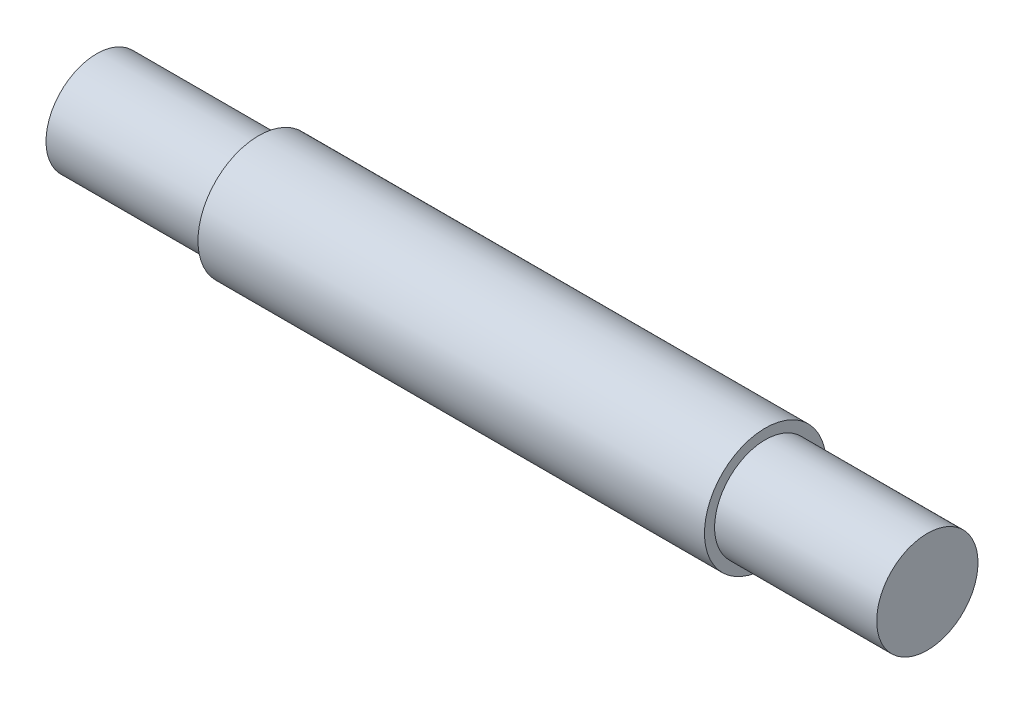
ISO-10303-21;
HEADER;
FILE_DESCRIPTION(('STEP AP214'),'2;1');
FILE_NAME('part.step','',(''),(''),'','','');
FILE_SCHEMA(('AUTOMOTIVE_DESIGN { 1 0 10303 214 1 1 1 1 }'));
ENDSEC;
DATA;
#1=APPLICATION_CONTEXT('core data for automotive mechanical design processes');
#2=APPLICATION_PROTOCOL_DEFINITION('international standard','automotive_design',2000,#1);
#3=PRODUCT_CONTEXT('',#1,'mechanical');
#4=PRODUCT('Part','Part','',(#3));
#5=PRODUCT_RELATED_PRODUCT_CATEGORY('part','',(#4));
#6=PRODUCT_DEFINITION_FORMATION('','',#4);
#7=PRODUCT_DEFINITION_CONTEXT('part definition',#1,'design');
#8=PRODUCT_DEFINITION('design','',#6,#7);
#9=PRODUCT_DEFINITION_SHAPE('','',#8);
#10=(LENGTH_UNIT() NAMED_UNIT(*) SI_UNIT(.MILLI.,.METRE.));
#11=(NAMED_UNIT(*) PLANE_ANGLE_UNIT() SI_UNIT($,.RADIAN.));
#12=(NAMED_UNIT(*) SI_UNIT($,.STERADIAN.) SOLID_ANGLE_UNIT());
#13=UNCERTAINTY_MEASURE_WITH_UNIT(LENGTH_MEASURE(1.E-05),#10,'distance_accuracy_value','');
#14=(GEOMETRIC_REPRESENTATION_CONTEXT(3) GLOBAL_UNCERTAINTY_ASSIGNED_CONTEXT((#13)) GLOBAL_UNIT_ASSIGNED_CONTEXT((#10,
#11,#12)) REPRESENTATION_CONTEXT('',''));
#15=CARTESIAN_POINT('',(0.,0.,0.));
#16=DIRECTION('',(0.,0.,1.));
#17=DIRECTION('',(1.,0.,0.));
#18=AXIS2_PLACEMENT_3D('',#15,#16,#17);
#19=CARTESIAN_POINT('',(50.,0.,0.));
#20=DIRECTION('',(-1.,0.,0.));
#21=DIRECTION('',(0.,0.,1.));
#22=AXIS2_PLACEMENT_3D('',#19,#20,#21);
#23=CYLINDRICAL_SURFACE('',#22,6.);
#24=CARTESIAN_POINT('',(50.,0.,0.));
#25=DIRECTION('',(1.,0.,0.));
#26=DIRECTION('',(0.,0.,-1.));
#27=AXIS2_PLACEMENT_3D('',#24,#25,#26);
#28=CIRCLE('',#27,6.);
#29=CARTESIAN_POINT('',(50.,0.,-6.));
#30=VERTEX_POINT('',#29);
#31=EDGE_CURVE('E51',#30,#30,#28,.T.);
#32=ORIENTED_EDGE('',*,*,#31,.F.);
#33=EDGE_LOOP('',(#32));
#34=FACE_BOUND('',#33,.T.);
#35=CARTESIAN_POINT('',(0.,0.,0.));
#36=DIRECTION('',(1.,0.,0.));
#37=DIRECTION('',(0.,0.,-1.));
#38=AXIS2_PLACEMENT_3D('',#35,#36,#37);
#39=CIRCLE('',#38,6.);
#40=CARTESIAN_POINT('',(0.,0.,-6.));
#41=VERTEX_POINT('',#40);
#42=EDGE_CURVE('E40',#41,#41,#39,.T.);
#43=ORIENTED_EDGE('',*,*,#42,.T.);
#44=EDGE_LOOP('',(#43));
#45=FACE_BOUND('',#44,.T.);
#46=ADVANCED_FACE('F37',(#34,#45),#23,.T.);
#47=CARTESIAN_POINT('',(50.,0.,0.));
#48=DIRECTION('',(1.,0.,0.));
#49=DIRECTION('',(0.,0.,-1.));
#50=AXIS2_PLACEMENT_3D('',#47,#48,#49);
#51=PLANE('',#50);
#52=CARTESIAN_POINT('',(50.,0.,0.));
#53=DIRECTION('',(1.,0.,0.));
#54=DIRECTION('',(0.,0.,-1.));
#55=AXIS2_PLACEMENT_3D('',#52,#53,#54);
#56=CIRCLE('',#55,5.);
#57=CARTESIAN_POINT('',(50.,0.,-5.));
#58=VERTEX_POINT('',#57);
#59=EDGE_CURVE('E10',#58,#58,#56,.T.);
#60=ORIENTED_EDGE('',*,*,#59,.F.);
#61=EDGE_LOOP('',(#60));
#62=FACE_BOUND('',#61,.T.);
#63=ORIENTED_EDGE('',*,*,#31,.T.);
#64=EDGE_LOOP('',(#63));
#65=FACE_BOUND('',#64,.T.);
#66=ADVANCED_FACE('F71',(#62,#65),#51,.T.);
#67=CARTESIAN_POINT('',(0.,0.,0.));
#68=DIRECTION('',(1.,0.,0.));
#69=DIRECTION('',(0.,0.,-1.));
#70=AXIS2_PLACEMENT_3D('',#67,#68,#69);
#71=PLANE('',#70);
#72=CARTESIAN_POINT('',(0.,0.,0.));
#73=DIRECTION('',(-1.,0.,0.));
#74=DIRECTION('',(0.,0.,1.));
#75=AXIS2_PLACEMENT_3D('',#72,#73,#74);
#76=CIRCLE('',#75,5.);
#77=CARTESIAN_POINT('',(0.,0.,5.));
#78=VERTEX_POINT('',#77);
#79=EDGE_CURVE('E45',#78,#78,#76,.T.);
#80=ORIENTED_EDGE('',*,*,#79,.F.);
#81=EDGE_LOOP('',(#80));
#82=FACE_BOUND('',#81,.T.);
#83=ORIENTED_EDGE('',*,*,#42,.F.);
#84=EDGE_LOOP('',(#83));
#85=FACE_BOUND('',#84,.T.);
#86=ADVANCED_FACE('F68',(#82,#85),#71,.F.);
#87=CARTESIAN_POINT('',(-16.,0.,0.));
#88=DIRECTION('',(1.,0.,0.));
#89=DIRECTION('',(0.,0.,-1.));
#90=AXIS2_PLACEMENT_3D('',#87,#88,#89);
#91=CYLINDRICAL_SURFACE('',#90,5.);
#92=CARTESIAN_POINT('',(-16.,0.,0.));
#93=DIRECTION('',(-1.,0.,0.));
#94=DIRECTION('',(0.,0.,1.));
#95=AXIS2_PLACEMENT_3D('',#92,#93,#94);
#96=CIRCLE('',#95,5.);
#97=CARTESIAN_POINT('',(-16.,0.,5.));
#98=VERTEX_POINT('',#97);
#99=EDGE_CURVE('E56',#98,#98,#96,.T.);
#100=ORIENTED_EDGE('',*,*,#99,.F.);
#101=EDGE_LOOP('',(#100));
#102=FACE_BOUND('',#101,.T.);
#103=ORIENTED_EDGE('',*,*,#79,.T.);
#104=EDGE_LOOP('',(#103));
#105=FACE_BOUND('',#104,.T.);
#106=ADVANCED_FACE('F70',(#102,#105),#91,.T.);
#107=CARTESIAN_POINT('',(-16.,0.,0.));
#108=DIRECTION('',(-1.,0.,0.));
#109=DIRECTION('',(0.,0.,1.));
#110=AXIS2_PLACEMENT_3D('',#107,#108,#109);
#111=PLANE('',#110);
#112=ORIENTED_EDGE('',*,*,#99,.T.);
#113=EDGE_LOOP('',(#112));
#114=FACE_BOUND('',#113,.T.);
#115=ADVANCED_FACE('F77',(#114),#111,.T.);
#116=CARTESIAN_POINT('',(66.,0.,0.));
#117=DIRECTION('',(-1.,0.,0.));
#118=DIRECTION('',(0.,0.,1.));
#119=AXIS2_PLACEMENT_3D('',#116,#117,#118);
#120=CYLINDRICAL_SURFACE('',#119,5.);
#121=CARTESIAN_POINT('',(66.,0.,0.));
#122=DIRECTION('',(1.,0.,0.));
#123=DIRECTION('',(0.,0.,-1.));
#124=AXIS2_PLACEMENT_3D('',#121,#122,#123);
#125=CIRCLE('',#124,5.);
#126=CARTESIAN_POINT('',(66.,0.,-5.));
#127=VERTEX_POINT('',#126);
#128=EDGE_CURVE('E55',#127,#127,#125,.T.);
#129=ORIENTED_EDGE('',*,*,#128,.F.);
#130=EDGE_LOOP('',(#129));
#131=FACE_BOUND('',#130,.T.);
#132=ORIENTED_EDGE('',*,*,#59,.T.);
#133=EDGE_LOOP('',(#132));
#134=FACE_BOUND('',#133,.T.);
#135=ADVANCED_FACE('F102',(#131,#134),#120,.T.);
#136=CARTESIAN_POINT('',(66.,0.,0.));
#137=DIRECTION('',(1.,0.,0.));
#138=DIRECTION('',(0.,0.,-1.));
#139=AXIS2_PLACEMENT_3D('',#136,#137,#138);
#140=PLANE('',#139);
#141=ORIENTED_EDGE('',*,*,#128,.T.);
#142=EDGE_LOOP('',(#141));
#143=FACE_BOUND('',#142,.T.);
#144=ADVANCED_FACE('F107',(#143),#140,.T.);
#145=CLOSED_SHELL('',(#46,#66,#86,#106,#115,#135,#144));
#146=MANIFOLD_SOLID_BREP('B2',#145);
#147=ADVANCED_BREP_SHAPE_REPRESENTATION('',(#18,#146),#14);
#148=SHAPE_DEFINITION_REPRESENTATION(#9,#147);
ENDSEC;
END-ISO-10303-21;
